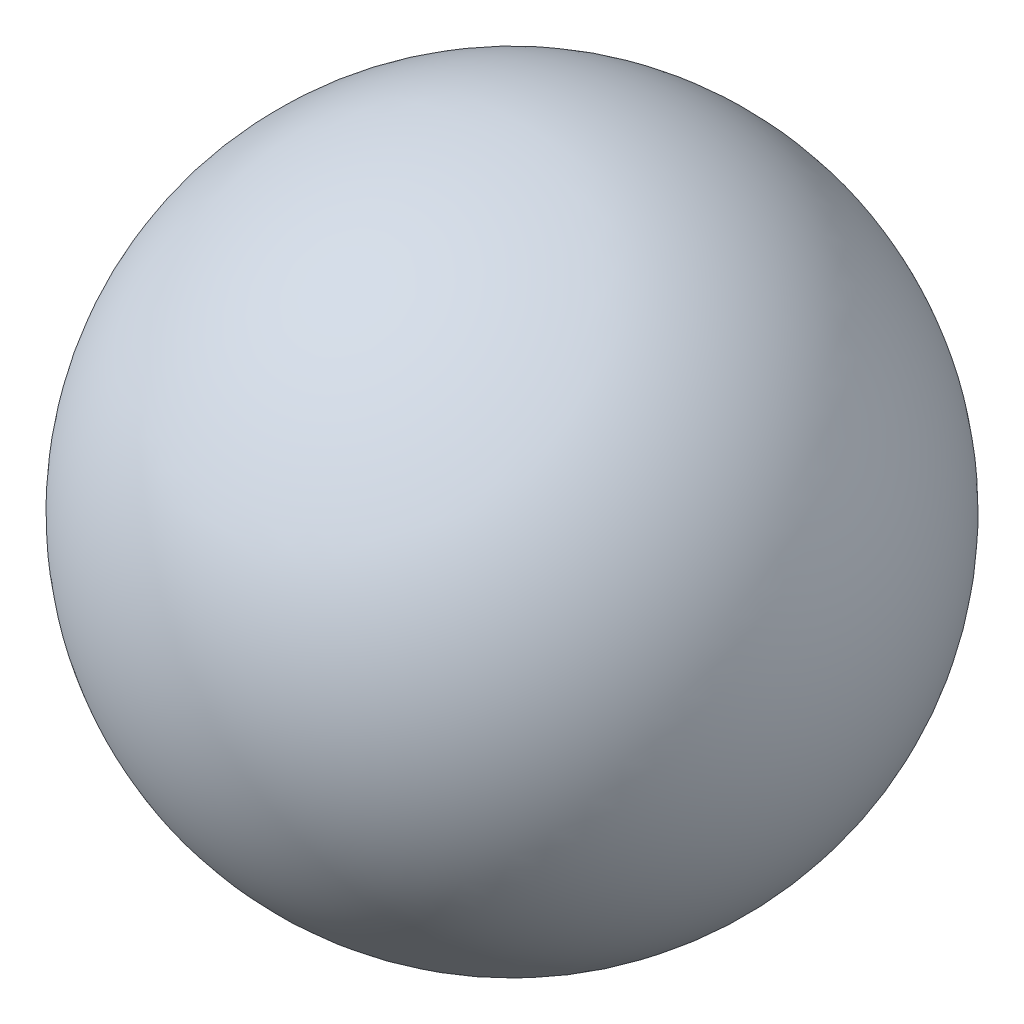
ISO-10303-21;
HEADER;
FILE_DESCRIPTION(('STEP AP214'),'2;1');
FILE_NAME('part.step','',(''),(''),'','','');
FILE_SCHEMA(('AUTOMOTIVE_DESIGN { 1 0 10303 214 1 1 1 1 }'));
ENDSEC;
DATA;
#1=APPLICATION_CONTEXT('core data for automotive mechanical design processes');
#2=APPLICATION_PROTOCOL_DEFINITION('international standard','automotive_design',2000,#1);
#3=PRODUCT_CONTEXT('',#1,'mechanical');
#4=PRODUCT('Part','Part','',(#3));
#5=PRODUCT_RELATED_PRODUCT_CATEGORY('part','',(#4));
#6=PRODUCT_DEFINITION_FORMATION('','',#4);
#7=PRODUCT_DEFINITION_CONTEXT('part definition',#1,'design');
#8=PRODUCT_DEFINITION('design','',#6,#7);
#9=PRODUCT_DEFINITION_SHAPE('','',#8);
#10=(LENGTH_UNIT() NAMED_UNIT(*) SI_UNIT(.MILLI.,.METRE.));
#11=(NAMED_UNIT(*) PLANE_ANGLE_UNIT() SI_UNIT($,.RADIAN.));
#12=(NAMED_UNIT(*) SI_UNIT($,.STERADIAN.) SOLID_ANGLE_UNIT());
#13=UNCERTAINTY_MEASURE_WITH_UNIT(LENGTH_MEASURE(1.E-05),#10,'distance_accuracy_value','');
#14=(GEOMETRIC_REPRESENTATION_CONTEXT(3) GLOBAL_UNCERTAINTY_ASSIGNED_CONTEXT((#13)) GLOBAL_UNIT_ASSIGNED_CONTEXT((#10,
#11,#12)) REPRESENTATION_CONTEXT('',''));
#15=CARTESIAN_POINT('',(0.,0.,0.));
#16=DIRECTION('',(0.,0.,1.));
#17=DIRECTION('',(1.,0.,0.));
#18=AXIS2_PLACEMENT_3D('',#15,#16,#17);
#19=CARTESIAN_POINT('',(-6.04599659483407,-3.,-5.23888587156228));
#20=DIRECTION('',(0.,0.,1.));
#21=DIRECTION('',(1.,0.,0.));
#22=AXIS2_PLACEMENT_3D('',#19,#20,#21);
#23=SPHERICAL_SURFACE('',#22,1.8);
#24=CARTESIAN_POINT('',(-6.04599659483407,-3.,-3.43888587156228));
#25=VERTEX_POINT('',#24);
#26=VERTEX_LOOP('',#25);
#27=FACE_BOUND('',#26,.T.);
#28=ADVANCED_FACE('F12',(#27),#23,.T.);
#29=CLOSED_SHELL('',(#28));
#30=MANIFOLD_SOLID_BREP('B1',#29);
#31=ADVANCED_BREP_SHAPE_REPRESENTATION('',(#18,#30),#14);
#32=SHAPE_DEFINITION_REPRESENTATION(#9,#31);
ENDSEC;
END-ISO-10303-21;
